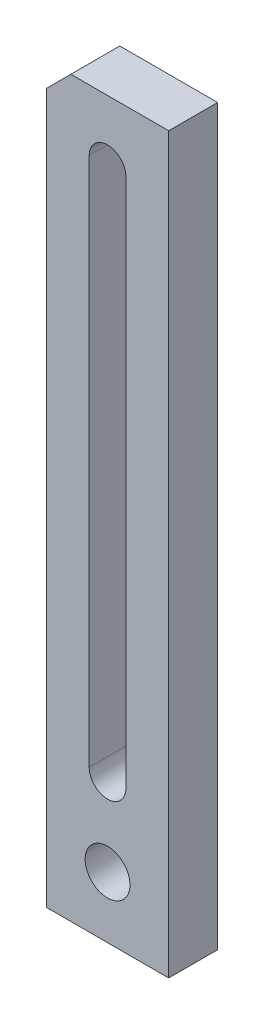
ISO-10303-21;
HEADER;
FILE_DESCRIPTION(('STEP AP214'),'2;1');
FILE_NAME('part.step','',(''),(''),'','','');
FILE_SCHEMA(('AUTOMOTIVE_DESIGN { 1 0 10303 214 1 1 1 1 }'));
ENDSEC;
DATA;
#1=APPLICATION_CONTEXT('core data for automotive mechanical design processes');
#2=APPLICATION_PROTOCOL_DEFINITION('international standard','automotive_design',2000,#1);
#3=PRODUCT_CONTEXT('',#1,'mechanical');
#4=PRODUCT('Part','Part','',(#3));
#5=PRODUCT_RELATED_PRODUCT_CATEGORY('part','',(#4));
#6=PRODUCT_DEFINITION_FORMATION('','',#4);
#7=PRODUCT_DEFINITION_CONTEXT('part definition',#1,'design');
#8=PRODUCT_DEFINITION('design','',#6,#7);
#9=PRODUCT_DEFINITION_SHAPE('','',#8);
#10=(LENGTH_UNIT() NAMED_UNIT(*) SI_UNIT(.MILLI.,.METRE.));
#11=(NAMED_UNIT(*) PLANE_ANGLE_UNIT() SI_UNIT($,.RADIAN.));
#12=(NAMED_UNIT(*) SI_UNIT($,.STERADIAN.) SOLID_ANGLE_UNIT());
#13=UNCERTAINTY_MEASURE_WITH_UNIT(LENGTH_MEASURE(1.E-05),#10,'distance_accuracy_value','');
#14=(GEOMETRIC_REPRESENTATION_CONTEXT(3) GLOBAL_UNCERTAINTY_ASSIGNED_CONTEXT((#13)) GLOBAL_UNIT_ASSIGNED_CONTEXT((#10,
#11,#12)) REPRESENTATION_CONTEXT('',''));
#15=CARTESIAN_POINT('',(0.,0.,0.));
#16=DIRECTION('',(0.,0.,1.));
#17=DIRECTION('',(1.,0.,0.));
#18=AXIS2_PLACEMENT_3D('',#15,#16,#17);
#19=CARTESIAN_POINT('',(15.,90.,12.));
#20=DIRECTION('',(-1.,0.,0.));
#21=DIRECTION('',(0.,-1.,0.));
#22=AXIS2_PLACEMENT_3D('',#19,#20,#21);
#23=PLANE('',#22);
#24=DIRECTION('',(0.,1.,0.));
#25=VECTOR('',#24,1.);
#26=CARTESIAN_POINT('',(15.,90.,0.));
#27=LINE('',#26,#25);
#28=CARTESIAN_POINT('',(15.,-90.,0.));
#29=VERTEX_POINT('',#28);
#30=CARTESIAN_POINT('',(15.,90.,0.));
#31=VERTEX_POINT('',#30);
#32=EDGE_CURVE('E148',#29,#31,#27,.T.);
#33=ORIENTED_EDGE('',*,*,#32,.T.);
#34=DIRECTION('',(0.,0.,-1.));
#35=VECTOR('',#34,1.);
#36=CARTESIAN_POINT('',(15.,90.,12.));
#37=LINE('',#36,#35);
#38=CARTESIAN_POINT('',(15.,90.,12.));
#39=VERTEX_POINT('',#38);
#40=EDGE_CURVE('E180',#39,#31,#37,.T.);
#41=ORIENTED_EDGE('',*,*,#40,.F.);
#42=DIRECTION('',(0.,1.,0.));
#43=VECTOR('',#42,1.);
#44=CARTESIAN_POINT('',(15.,90.,12.));
#45=LINE('',#44,#43);
#46=CARTESIAN_POINT('',(15.,-90.,12.));
#47=VERTEX_POINT('',#46);
#48=EDGE_CURVE('E157',#47,#39,#45,.T.);
#49=ORIENTED_EDGE('',*,*,#48,.F.);
#50=DIRECTION('',(0.,0.,-1.));
#51=VECTOR('',#50,1.);
#52=CARTESIAN_POINT('',(15.,-90.,12.));
#53=LINE('',#52,#51);
#54=EDGE_CURVE('E167',#47,#29,#53,.T.);
#55=ORIENTED_EDGE('',*,*,#54,.T.);
#56=EDGE_LOOP('',(#33,#41,#49,#55));
#57=FACE_BOUND('',#56,.T.);
#58=ADVANCED_FACE('F37',(#57),#23,.F.);
#59=CARTESIAN_POINT('',(-15.,90.,12.));
#60=DIRECTION('',(0.,-1.,0.));
#61=DIRECTION('',(0.,0.,-1.));
#62=AXIS2_PLACEMENT_3D('',#59,#60,#61);
#63=PLANE('',#62);
#64=DIRECTION('',(-1.,0.,0.));
#65=VECTOR('',#64,1.);
#66=CARTESIAN_POINT('',(-15.,90.,0.));
#67=LINE('',#66,#65);
#68=CARTESIAN_POINT('',(-8.99999999999995,90.,0.));
#69=VERTEX_POINT('',#68);
#70=EDGE_CURVE('E170',#31,#69,#67,.T.);
#71=ORIENTED_EDGE('',*,*,#70,.T.);
#72=DIRECTION('',(0.,0.,1.));
#73=VECTOR('',#72,1.);
#74=CARTESIAN_POINT('',(-8.99999999999995,90.,12.));
#75=LINE('',#74,#73);
#76=CARTESIAN_POINT('',(-8.99999999999995,90.,12.));
#77=VERTEX_POINT('',#76);
#78=EDGE_CURVE('E46',#69,#77,#75,.T.);
#79=ORIENTED_EDGE('',*,*,#78,.T.);
#80=DIRECTION('',(-1.,0.,0.));
#81=VECTOR('',#80,1.);
#82=CARTESIAN_POINT('',(-15.,90.,12.));
#83=LINE('',#82,#81);
#84=EDGE_CURVE('E160',#39,#77,#83,.T.);
#85=ORIENTED_EDGE('',*,*,#84,.F.);
#86=ORIENTED_EDGE('',*,*,#40,.T.);
#87=EDGE_LOOP('',(#71,#79,#85,#86));
#88=FACE_BOUND('',#87,.T.);
#89=ADVANCED_FACE('F211',(#88),#63,.F.);
#90=CARTESIAN_POINT('',(-15.,90.,12.));
#91=DIRECTION('',(1.,0.,0.));
#92=DIRECTION('',(0.,1.,0.));
#93=AXIS2_PLACEMENT_3D('',#90,#91,#92);
#94=PLANE('',#93);
#95=DIRECTION('',(0.,-1.,0.));
#96=VECTOR('',#95,1.);
#97=CARTESIAN_POINT('',(-15.,90.,12.));
#98=LINE('',#97,#96);
#99=CARTESIAN_POINT('',(-15.,84.,12.));
#100=VERTEX_POINT('',#99);
#101=CARTESIAN_POINT('',(-15.,-90.,12.));
#102=VERTEX_POINT('',#101);
#103=EDGE_CURVE('E163',#100,#102,#98,.T.);
#104=ORIENTED_EDGE('',*,*,#103,.F.);
#105=DIRECTION('',(0.,0.,-1.));
#106=VECTOR('',#105,1.);
#107=CARTESIAN_POINT('',(-15.,84.,12.));
#108=LINE('',#107,#106);
#109=CARTESIAN_POINT('',(-15.,84.,0.));
#110=VERTEX_POINT('',#109);
#111=EDGE_CURVE('E183',#100,#110,#108,.T.);
#112=ORIENTED_EDGE('',*,*,#111,.T.);
#113=DIRECTION('',(0.,-1.,0.));
#114=VECTOR('',#113,1.);
#115=CARTESIAN_POINT('',(-15.,90.,0.));
#116=LINE('',#115,#114);
#117=CARTESIAN_POINT('',(-15.,-90.,0.));
#118=VERTEX_POINT('',#117);
#119=EDGE_CURVE('E172',#110,#118,#116,.T.);
#120=ORIENTED_EDGE('',*,*,#119,.T.);
#121=DIRECTION('',(0.,0.,-1.));
#122=VECTOR('',#121,1.);
#123=CARTESIAN_POINT('',(-15.,-90.,12.));
#124=LINE('',#123,#122);
#125=EDGE_CURVE('E177',#102,#118,#124,.T.);
#126=ORIENTED_EDGE('',*,*,#125,.F.);
#127=EDGE_LOOP('',(#104,#112,#120,#126));
#128=FACE_BOUND('',#127,.T.);
#129=ADVANCED_FACE('F189',(#128),#94,.F.);
#130=CARTESIAN_POINT('',(-15.,-90.,12.));
#131=DIRECTION('',(0.,1.,0.));
#132=DIRECTION('',(0.,0.,1.));
#133=AXIS2_PLACEMENT_3D('',#130,#131,#132);
#134=PLANE('',#133);
#135=DIRECTION('',(1.,0.,0.));
#136=VECTOR('',#135,1.);
#137=CARTESIAN_POINT('',(-15.,-90.,0.));
#138=LINE('',#137,#136);
#139=EDGE_CURVE('E161',#118,#29,#138,.T.);
#140=ORIENTED_EDGE('',*,*,#139,.T.);
#141=ORIENTED_EDGE('',*,*,#54,.F.);
#142=DIRECTION('',(1.,0.,0.));
#143=VECTOR('',#142,1.);
#144=CARTESIAN_POINT('',(-15.,-90.,12.));
#145=LINE('',#144,#143);
#146=EDGE_CURVE('E165',#102,#47,#145,.T.);
#147=ORIENTED_EDGE('',*,*,#146,.F.);
#148=ORIENTED_EDGE('',*,*,#125,.T.);
#149=EDGE_LOOP('',(#140,#141,#147,#148));
#150=FACE_BOUND('',#149,.T.);
#151=ADVANCED_FACE('F197',(#150),#134,.F.);
#152=CARTESIAN_POINT('',(0.,0.,12.));
#153=DIRECTION('',(0.,0.,1.));
#154=DIRECTION('',(1.,0.,0.));
#155=AXIS2_PLACEMENT_3D('',#152,#153,#154);
#156=PLANE('',#155);
#157=CARTESIAN_POINT('',(0.,75.,12.));
#158=DIRECTION('',(0.,0.,1.));
#159=DIRECTION('',(1.,0.,0.));
#160=AXIS2_PLACEMENT_3D('',#157,#158,#159);
#161=CIRCLE('',#160,4.5);
#162=CARTESIAN_POINT('',(4.5,75.,12.));
#163=VERTEX_POINT('',#162);
#164=CARTESIAN_POINT('',(-4.5,75.,12.));
#165=VERTEX_POINT('',#164);
#166=EDGE_CURVE('E114',#163,#165,#161,.T.);
#167=ORIENTED_EDGE('',*,*,#166,.F.);
#168=DIRECTION('',(0.,1.,0.));
#169=VECTOR('',#168,1.);
#170=CARTESIAN_POINT('',(4.5,75.,12.));
#171=LINE('',#170,#169);
#172=CARTESIAN_POINT('',(4.49999999999999,-55.,12.));
#173=VERTEX_POINT('',#172);
#174=EDGE_CURVE('E132',#173,#163,#171,.T.);
#175=ORIENTED_EDGE('',*,*,#174,.F.);
#176=CARTESIAN_POINT('',(0.,-55.,12.));
#177=DIRECTION('',(0.,0.,1.));
#178=DIRECTION('',(1.,0.,0.));
#179=AXIS2_PLACEMENT_3D('',#176,#177,#178);
#180=CIRCLE('',#179,4.5);
#181=CARTESIAN_POINT('',(-4.5,-55.,12.));
#182=VERTEX_POINT('',#181);
#183=EDGE_CURVE('E135',#182,#173,#180,.T.);
#184=ORIENTED_EDGE('',*,*,#183,.F.);
#185=DIRECTION('',(0.,-1.,0.));
#186=VECTOR('',#185,1.);
#187=CARTESIAN_POINT('',(-4.5,75.,12.));
#188=LINE('',#187,#186);
#189=EDGE_CURVE('E141',#165,#182,#188,.T.);
#190=ORIENTED_EDGE('',*,*,#189,.F.);
#191=EDGE_LOOP('',(#167,#175,#184,#190));
#192=FACE_BOUND('',#191,.T.);
#193=CARTESIAN_POINT('',(0.,-75.,12.));
#194=DIRECTION('',(0.,0.,1.));
#195=DIRECTION('',(1.,0.,0.));
#196=AXIS2_PLACEMENT_3D('',#193,#194,#195);
#197=CIRCLE('',#196,5.5);
#198=CARTESIAN_POINT('',(5.49999999999999,-75.,12.));
#199=VERTEX_POINT('',#198);
#200=EDGE_CURVE('E154',#199,#199,#197,.T.);
#201=ORIENTED_EDGE('',*,*,#200,.F.);
#202=EDGE_LOOP('',(#201));
#203=FACE_BOUND('',#202,.T.);
#204=ORIENTED_EDGE('',*,*,#84,.T.);
#205=DIRECTION('',(0.707106781186551,0.707106781186544,0.));
#206=VECTOR('',#205,1.);
#207=CARTESIAN_POINT('',(-49.4999999999999,49.5000000000004,12.));
#208=LINE('',#207,#206);
#209=EDGE_CURVE('E11',#77,#100,#208,.F.);
#210=ORIENTED_EDGE('',*,*,#209,.T.);
#211=ORIENTED_EDGE('',*,*,#103,.T.);
#212=ORIENTED_EDGE('',*,*,#146,.T.);
#213=ORIENTED_EDGE('',*,*,#48,.T.);
#214=EDGE_LOOP('',(#204,#210,#211,#212,#213));
#215=FACE_BOUND('',#214,.T.);
#216=ADVANCED_FACE('F203',(#192,#203,#215),#156,.T.);
#217=CARTESIAN_POINT('',(0.,0.,0.));
#218=DIRECTION('',(0.,0.,1.));
#219=DIRECTION('',(1.,0.,0.));
#220=AXIS2_PLACEMENT_3D('',#217,#218,#219);
#221=PLANE('',#220);
#222=DIRECTION('',(0.,1.,0.));
#223=VECTOR('',#222,1.);
#224=CARTESIAN_POINT('',(4.5,75.,0.));
#225=LINE('',#224,#223);
#226=CARTESIAN_POINT('',(4.49999999999999,-55.,0.));
#227=VERTEX_POINT('',#226);
#228=CARTESIAN_POINT('',(4.5,75.,0.));
#229=VERTEX_POINT('',#228);
#230=EDGE_CURVE('E119',#227,#229,#225,.T.);
#231=ORIENTED_EDGE('',*,*,#230,.T.);
#232=CARTESIAN_POINT('',(0.,75.,0.));
#233=DIRECTION('',(0.,0.,1.));
#234=DIRECTION('',(1.,0.,0.));
#235=AXIS2_PLACEMENT_3D('',#232,#233,#234);
#236=CIRCLE('',#235,4.5);
#237=CARTESIAN_POINT('',(-4.5,75.,0.));
#238=VERTEX_POINT('',#237);
#239=EDGE_CURVE('E111',#229,#238,#236,.T.);
#240=ORIENTED_EDGE('',*,*,#239,.T.);
#241=DIRECTION('',(0.,-1.,0.));
#242=VECTOR('',#241,1.);
#243=CARTESIAN_POINT('',(-4.5,75.,0.));
#244=LINE('',#243,#242);
#245=CARTESIAN_POINT('',(-4.5,-55.,0.));
#246=VERTEX_POINT('',#245);
#247=EDGE_CURVE('E123',#238,#246,#244,.T.);
#248=ORIENTED_EDGE('',*,*,#247,.T.);
#249=CARTESIAN_POINT('',(0.,-55.,0.));
#250=DIRECTION('',(0.,0.,1.));
#251=DIRECTION('',(1.,0.,0.));
#252=AXIS2_PLACEMENT_3D('',#249,#250,#251);
#253=CIRCLE('',#252,4.5);
#254=EDGE_CURVE('E127',#246,#227,#253,.T.);
#255=ORIENTED_EDGE('',*,*,#254,.T.);
#256=EDGE_LOOP('',(#231,#240,#248,#255));
#257=FACE_BOUND('',#256,.T.);
#258=CARTESIAN_POINT('',(0.,-75.,0.));
#259=DIRECTION('',(0.,0.,1.));
#260=DIRECTION('',(1.,0.,0.));
#261=AXIS2_PLACEMENT_3D('',#258,#259,#260);
#262=CIRCLE('',#261,5.5);
#263=CARTESIAN_POINT('',(5.49999999999999,-75.,0.));
#264=VERTEX_POINT('',#263);
#265=EDGE_CURVE('E142',#264,#264,#262,.T.);
#266=ORIENTED_EDGE('',*,*,#265,.T.);
#267=EDGE_LOOP('',(#266));
#268=FACE_BOUND('',#267,.T.);
#269=ORIENTED_EDGE('',*,*,#119,.F.);
#270=DIRECTION('',(-0.707106781186551,-0.707106781186544,0.));
#271=VECTOR('',#270,1.);
#272=CARTESIAN_POINT('',(-15.,84.,0.));
#273=LINE('',#272,#271);
#274=EDGE_CURVE('E60',#110,#69,#273,.F.);
#275=ORIENTED_EDGE('',*,*,#274,.T.);
#276=ORIENTED_EDGE('',*,*,#70,.F.);
#277=ORIENTED_EDGE('',*,*,#32,.F.);
#278=ORIENTED_EDGE('',*,*,#139,.F.);
#279=EDGE_LOOP('',(#269,#275,#276,#277,#278));
#280=FACE_BOUND('',#279,.T.);
#281=ADVANCED_FACE('F129',(#257,#268,#280),#221,.F.);
#282=CARTESIAN_POINT('',(0.,-75.,0.));
#283=DIRECTION('',(0.,0.,1.));
#284=DIRECTION('',(1.,0.,0.));
#285=AXIS2_PLACEMENT_3D('',#282,#283,#284);
#286=CYLINDRICAL_SURFACE('',#285,5.5);
#287=ORIENTED_EDGE('',*,*,#265,.F.);
#288=EDGE_LOOP('',(#287));
#289=FACE_BOUND('',#288,.T.);
#290=ORIENTED_EDGE('',*,*,#200,.T.);
#291=EDGE_LOOP('',(#290));
#292=FACE_BOUND('',#291,.T.);
#293=ADVANCED_FACE('F223',(#289,#292),#286,.F.);
#294=CARTESIAN_POINT('',(0.,75.,0.));
#295=DIRECTION('',(0.,0.,1.));
#296=DIRECTION('',(1.,0.,0.));
#297=AXIS2_PLACEMENT_3D('',#294,#295,#296);
#298=CYLINDRICAL_SURFACE('',#297,4.5);
#299=ORIENTED_EDGE('',*,*,#166,.T.);
#300=DIRECTION('',(0.,0.,1.));
#301=VECTOR('',#300,1.);
#302=CARTESIAN_POINT('',(-4.5,75.,0.));
#303=LINE('',#302,#301);
#304=EDGE_CURVE('E107',#238,#165,#303,.T.);
#305=ORIENTED_EDGE('',*,*,#304,.F.);
#306=ORIENTED_EDGE('',*,*,#239,.F.);
#307=DIRECTION('',(0.,0.,1.));
#308=VECTOR('',#307,1.);
#309=CARTESIAN_POINT('',(4.5,75.,0.));
#310=LINE('',#309,#308);
#311=EDGE_CURVE('E146',#229,#163,#310,.T.);
#312=ORIENTED_EDGE('',*,*,#311,.T.);
#313=EDGE_LOOP('',(#299,#305,#306,#312));
#314=FACE_BOUND('',#313,.T.);
#315=ADVANCED_FACE('F109',(#314),#298,.F.);
#316=CARTESIAN_POINT('',(4.5,75.,0.));
#317=DIRECTION('',(1.,0.,0.));
#318=DIRECTION('',(0.,1.,0.));
#319=AXIS2_PLACEMENT_3D('',#316,#317,#318);
#320=PLANE('',#319);
#321=ORIENTED_EDGE('',*,*,#174,.T.);
#322=ORIENTED_EDGE('',*,*,#311,.F.);
#323=ORIENTED_EDGE('',*,*,#230,.F.);
#324=DIRECTION('',(0.,0.,1.));
#325=VECTOR('',#324,1.);
#326=CARTESIAN_POINT('',(4.49999999999999,-55.,0.));
#327=LINE('',#326,#325);
#328=EDGE_CURVE('E149',#227,#173,#327,.T.);
#329=ORIENTED_EDGE('',*,*,#328,.T.);
#330=EDGE_LOOP('',(#321,#322,#323,#329));
#331=FACE_BOUND('',#330,.T.);
#332=ADVANCED_FACE('F231',(#331),#320,.F.);
#333=CARTESIAN_POINT('',(0.,-55.,0.));
#334=DIRECTION('',(0.,0.,1.));
#335=DIRECTION('',(1.,0.,0.));
#336=AXIS2_PLACEMENT_3D('',#333,#334,#335);
#337=CYLINDRICAL_SURFACE('',#336,4.5);
#338=ORIENTED_EDGE('',*,*,#183,.T.);
#339=ORIENTED_EDGE('',*,*,#328,.F.);
#340=ORIENTED_EDGE('',*,*,#254,.F.);
#341=DIRECTION('',(0.,0.,1.));
#342=VECTOR('',#341,1.);
#343=CARTESIAN_POINT('',(-4.5,-55.,0.));
#344=LINE('',#343,#342);
#345=EDGE_CURVE('E118',#246,#182,#344,.T.);
#346=ORIENTED_EDGE('',*,*,#345,.T.);
#347=EDGE_LOOP('',(#338,#339,#340,#346));
#348=FACE_BOUND('',#347,.T.);
#349=ADVANCED_FACE('F208',(#348),#337,.F.);
#350=CARTESIAN_POINT('',(-4.5,75.,0.));
#351=DIRECTION('',(-1.,0.,0.));
#352=DIRECTION('',(0.,-1.,0.));
#353=AXIS2_PLACEMENT_3D('',#350,#351,#352);
#354=PLANE('',#353);
#355=ORIENTED_EDGE('',*,*,#189,.T.);
#356=ORIENTED_EDGE('',*,*,#345,.F.);
#357=ORIENTED_EDGE('',*,*,#247,.F.);
#358=ORIENTED_EDGE('',*,*,#304,.T.);
#359=EDGE_LOOP('',(#355,#356,#357,#358));
#360=FACE_BOUND('',#359,.T.);
#361=ADVANCED_FACE('F124',(#360),#354,.F.);
#362=CARTESIAN_POINT('',(-15.,84.,12.));
#363=DIRECTION('',(0.707106781186544,-0.707106781186551,0.));
#364=DIRECTION('',(0.,0.,-1.));
#365=AXIS2_PLACEMENT_3D('',#362,#363,#364);
#366=PLANE('',#365);
#367=ORIENTED_EDGE('',*,*,#209,.F.);
#368=ORIENTED_EDGE('',*,*,#78,.F.);
#369=ORIENTED_EDGE('',*,*,#274,.F.);
#370=ORIENTED_EDGE('',*,*,#111,.F.);
#371=EDGE_LOOP('',(#367,#368,#369,#370));
#372=FACE_BOUND('',#371,.T.);
#373=ADVANCED_FACE('F40',(#372),#366,.F.);
#374=CLOSED_SHELL('',(#58,#89,#129,#151,#216,#281,#293,#315,#332,#349,#361,#373));
#375=MANIFOLD_SOLID_BREP('B2',#374);
#376=ADVANCED_BREP_SHAPE_REPRESENTATION('',(#18,#375),#14);
#377=SHAPE_DEFINITION_REPRESENTATION(#9,#376);
ENDSEC;
END-ISO-10303-21;
